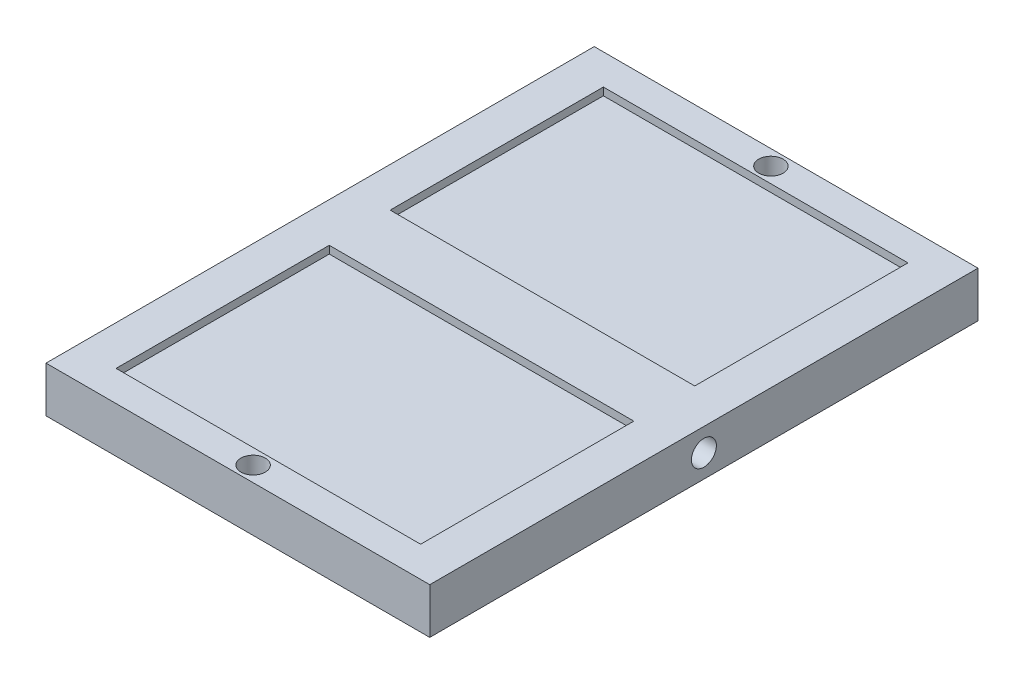
ISO-10303-21;
HEADER;
FILE_DESCRIPTION(('STEP AP214'),'2;1');
FILE_NAME('part.step','',(''),(''),'','','');
FILE_SCHEMA(('AUTOMOTIVE_DESIGN { 1 0 10303 214 1 1 1 1 }'));
ENDSEC;
DATA;
#1=APPLICATION_CONTEXT('core data for automotive mechanical design processes');
#2=APPLICATION_PROTOCOL_DEFINITION('international standard','automotive_design',2000,#1);
#3=PRODUCT_CONTEXT('',#1,'mechanical');
#4=PRODUCT('Part','Part','',(#3));
#5=PRODUCT_RELATED_PRODUCT_CATEGORY('part','',(#4));
#6=PRODUCT_DEFINITION_FORMATION('','',#4);
#7=PRODUCT_DEFINITION_CONTEXT('part definition',#1,'design');
#8=PRODUCT_DEFINITION('design','',#6,#7);
#9=PRODUCT_DEFINITION_SHAPE('','',#8);
#10=(LENGTH_UNIT() NAMED_UNIT(*) SI_UNIT(.MILLI.,.METRE.));
#11=(NAMED_UNIT(*) PLANE_ANGLE_UNIT() SI_UNIT($,.RADIAN.));
#12=(NAMED_UNIT(*) SI_UNIT($,.STERADIAN.) SOLID_ANGLE_UNIT());
#13=UNCERTAINTY_MEASURE_WITH_UNIT(LENGTH_MEASURE(1.E-05),#10,'distance_accuracy_value','');
#14=(GEOMETRIC_REPRESENTATION_CONTEXT(3) GLOBAL_UNCERTAINTY_ASSIGNED_CONTEXT((#13)) GLOBAL_UNIT_ASSIGNED_CONTEXT((#10,
#11,#12)) REPRESENTATION_CONTEXT('',''));
#15=CARTESIAN_POINT('',(0.,0.,0.));
#16=DIRECTION('',(0.,0.,1.));
#17=DIRECTION('',(1.,0.,0.));
#18=AXIS2_PLACEMENT_3D('',#15,#16,#17);
#19=CARTESIAN_POINT('',(-63.,15.,-90.));
#20=DIRECTION('',(1.,0.,0.));
#21=DIRECTION('',(0.,0.,-1.));
#22=AXIS2_PLACEMENT_3D('',#19,#20,#21);
#23=PLANE('',#22);
#24=CARTESIAN_POINT('',(-63.,7.5,0.));
#25=DIRECTION('',(1.,0.,0.));
#26=DIRECTION('',(0.,0.,-1.));
#27=AXIS2_PLACEMENT_3D('',#24,#25,#26);
#28=CIRCLE('',#27,4.1);
#29=CARTESIAN_POINT('',(-63.,7.5,-4.1));
#30=VERTEX_POINT('',#29);
#31=EDGE_CURVE('E303',#30,#30,#28,.T.);
#32=ORIENTED_EDGE('',*,*,#31,.T.);
#33=EDGE_LOOP('',(#32));
#34=FACE_BOUND('',#33,.T.);
#35=DIRECTION('',(0.,0.,1.));
#36=VECTOR('',#35,1.);
#37=CARTESIAN_POINT('',(-63.,0.,-90.));
#38=LINE('',#37,#36);
#39=CARTESIAN_POINT('',(-63.,0.,-90.));
#40=VERTEX_POINT('',#39);
#41=CARTESIAN_POINT('',(-63.,0.,90.));
#42=VERTEX_POINT('',#41);
#43=EDGE_CURVE('E160',#40,#42,#38,.T.);
#44=ORIENTED_EDGE('',*,*,#43,.T.);
#45=DIRECTION('',(0.,-1.,0.));
#46=VECTOR('',#45,1.);
#47=CARTESIAN_POINT('',(-63.,15.,90.));
#48=LINE('',#47,#46);
#49=CARTESIAN_POINT('',(-63.,15.,90.));
#50=VERTEX_POINT('',#49);
#51=EDGE_CURVE('E11',#50,#42,#48,.T.);
#52=ORIENTED_EDGE('',*,*,#51,.F.);
#53=DIRECTION('',(0.,0.,1.));
#54=VECTOR('',#53,1.);
#55=CARTESIAN_POINT('',(-63.,15.,-90.));
#56=LINE('',#55,#54);
#57=CARTESIAN_POINT('',(-63.,15.,-90.));
#58=VERTEX_POINT('',#57);
#59=EDGE_CURVE('E193',#58,#50,#56,.T.);
#60=ORIENTED_EDGE('',*,*,#59,.F.);
#61=DIRECTION('',(0.,-1.,0.));
#62=VECTOR('',#61,1.);
#63=CARTESIAN_POINT('',(-63.,15.,-90.));
#64=LINE('',#63,#62);
#65=EDGE_CURVE('E203',#58,#40,#64,.T.);
#66=ORIENTED_EDGE('',*,*,#65,.T.);
#67=EDGE_LOOP('',(#44,#52,#60,#66));
#68=FACE_BOUND('',#67,.T.);
#69=ADVANCED_FACE('F33',(#34,#68),#23,.F.);
#70=CARTESIAN_POINT('',(63.,15.,90.));
#71=DIRECTION('',(0.,0.,-1.));
#72=DIRECTION('',(-1.,0.,0.));
#73=AXIS2_PLACEMENT_3D('',#70,#71,#72);
#74=PLANE('',#73);
#75=DIRECTION('',(1.,0.,0.));
#76=VECTOR('',#75,1.);
#77=CARTESIAN_POINT('',(63.,0.,90.));
#78=LINE('',#77,#76);
#79=CARTESIAN_POINT('',(63.,0.,90.));
#80=VERTEX_POINT('',#79);
#81=EDGE_CURVE('E206',#42,#80,#78,.T.);
#82=ORIENTED_EDGE('',*,*,#81,.T.);
#83=DIRECTION('',(0.,-1.,0.));
#84=VECTOR('',#83,1.);
#85=CARTESIAN_POINT('',(63.,15.,90.));
#86=LINE('',#85,#84);
#87=CARTESIAN_POINT('',(63.,15.,90.));
#88=VERTEX_POINT('',#87);
#89=EDGE_CURVE('E40',#88,#80,#86,.T.);
#90=ORIENTED_EDGE('',*,*,#89,.F.);
#91=DIRECTION('',(1.,0.,0.));
#92=VECTOR('',#91,1.);
#93=CARTESIAN_POINT('',(63.,15.,90.));
#94=LINE('',#93,#92);
#95=EDGE_CURVE('E196',#50,#88,#94,.T.);
#96=ORIENTED_EDGE('',*,*,#95,.F.);
#97=ORIENTED_EDGE('',*,*,#51,.T.);
#98=EDGE_LOOP('',(#82,#90,#96,#97));
#99=FACE_BOUND('',#98,.T.);
#100=ADVANCED_FACE('F236',(#99),#74,.F.);
#101=CARTESIAN_POINT('',(63.,15.,-90.));
#102=DIRECTION('',(-1.,0.,0.));
#103=DIRECTION('',(0.,0.,1.));
#104=AXIS2_PLACEMENT_3D('',#101,#102,#103);
#105=PLANE('',#104);
#106=CARTESIAN_POINT('',(63.,7.5,0.));
#107=DIRECTION('',(1.,0.,0.));
#108=DIRECTION('',(0.,0.,-1.));
#109=AXIS2_PLACEMENT_3D('',#106,#107,#108);
#110=CIRCLE('',#109,4.1);
#111=CARTESIAN_POINT('',(63.,7.5,-4.1));
#112=VERTEX_POINT('',#111);
#113=EDGE_CURVE('E306',#112,#112,#110,.T.);
#114=ORIENTED_EDGE('',*,*,#113,.F.);
#115=EDGE_LOOP('',(#114));
#116=FACE_BOUND('',#115,.T.);
#117=DIRECTION('',(0.,0.,-1.));
#118=VECTOR('',#117,1.);
#119=CARTESIAN_POINT('',(63.,0.,-90.));
#120=LINE('',#119,#118);
#121=CARTESIAN_POINT('',(63.,0.,-90.));
#122=VERTEX_POINT('',#121);
#123=EDGE_CURVE('E208',#80,#122,#120,.T.);
#124=ORIENTED_EDGE('',*,*,#123,.T.);
#125=DIRECTION('',(0.,-1.,0.));
#126=VECTOR('',#125,1.);
#127=CARTESIAN_POINT('',(63.,15.,-90.));
#128=LINE('',#127,#126);
#129=CARTESIAN_POINT('',(63.,15.,-90.));
#130=VERTEX_POINT('',#129);
#131=EDGE_CURVE('E213',#130,#122,#128,.T.);
#132=ORIENTED_EDGE('',*,*,#131,.F.);
#133=DIRECTION('',(0.,0.,-1.));
#134=VECTOR('',#133,1.);
#135=CARTESIAN_POINT('',(63.,15.,-90.));
#136=LINE('',#135,#134);
#137=EDGE_CURVE('E199',#88,#130,#136,.T.);
#138=ORIENTED_EDGE('',*,*,#137,.F.);
#139=ORIENTED_EDGE('',*,*,#89,.T.);
#140=EDGE_LOOP('',(#124,#132,#138,#139));
#141=FACE_BOUND('',#140,.T.);
#142=ADVANCED_FACE('F220',(#116,#141),#105,.F.);
#143=CARTESIAN_POINT('',(63.,15.,-90.));
#144=DIRECTION('',(0.,0.,1.));
#145=DIRECTION('',(1.,0.,0.));
#146=AXIS2_PLACEMENT_3D('',#143,#144,#145);
#147=PLANE('',#146);
#148=DIRECTION('',(-1.,0.,0.));
#149=VECTOR('',#148,1.);
#150=CARTESIAN_POINT('',(63.,0.,-90.));
#151=LINE('',#150,#149);
#152=EDGE_CURVE('E197',#122,#40,#151,.T.);
#153=ORIENTED_EDGE('',*,*,#152,.T.);
#154=ORIENTED_EDGE('',*,*,#65,.F.);
#155=DIRECTION('',(-1.,0.,0.));
#156=VECTOR('',#155,1.);
#157=CARTESIAN_POINT('',(63.,15.,-90.));
#158=LINE('',#157,#156);
#159=EDGE_CURVE('E201',#130,#58,#158,.T.);
#160=ORIENTED_EDGE('',*,*,#159,.F.);
#161=ORIENTED_EDGE('',*,*,#131,.T.);
#162=EDGE_LOOP('',(#153,#154,#160,#161));
#163=FACE_BOUND('',#162,.T.);
#164=ADVANCED_FACE('F229',(#163),#147,.F.);
#165=CARTESIAN_POINT('',(0.,15.,0.));
#166=DIRECTION('',(0.,-1.,0.));
#167=DIRECTION('',(0.,0.,-1.));
#168=AXIS2_PLACEMENT_3D('',#165,#166,#167);
#169=PLANE('',#168);
#170=CARTESIAN_POINT('',(0.,15.,85.));
#171=DIRECTION('',(0.,-1.,0.));
#172=DIRECTION('',(0.,0.,-1.));
#173=AXIS2_PLACEMENT_3D('',#170,#171,#172);
#174=CIRCLE('',#173,4.);
#175=CARTESIAN_POINT('',(0.,15.,81.));
#176=VERTEX_POINT('',#175);
#177=EDGE_CURVE('E147',#176,#176,#174,.F.);
#178=ORIENTED_EDGE('',*,*,#177,.F.);
#179=EDGE_LOOP('',(#178));
#180=FACE_BOUND('',#179,.T.);
#181=CARTESIAN_POINT('',(0.,15.,-85.));
#182=DIRECTION('',(0.,-1.,0.));
#183=DIRECTION('',(0.,0.,-1.));
#184=AXIS2_PLACEMENT_3D('',#181,#182,#183);
#185=CIRCLE('',#184,4.);
#186=CARTESIAN_POINT('',(0.,15.,-89.));
#187=VERTEX_POINT('',#186);
#188=EDGE_CURVE('E314',#187,#187,#185,.F.);
#189=ORIENTED_EDGE('',*,*,#188,.F.);
#190=EDGE_LOOP('',(#189));
#191=FACE_BOUND('',#190,.T.);
#192=DIRECTION('',(1.,0.,0.));
#193=VECTOR('',#192,1.);
#194=CARTESIAN_POINT('',(-50.,15.,80.));
#195=LINE('',#194,#193);
#196=CARTESIAN_POINT('',(-50.,15.,80.));
#197=VERTEX_POINT('',#196);
#198=CARTESIAN_POINT('',(50.,15.,80.));
#199=VERTEX_POINT('',#198);
#200=EDGE_CURVE('E153',#197,#199,#195,.T.);
#201=ORIENTED_EDGE('',*,*,#200,.F.);
#202=DIRECTION('',(0.,0.,1.));
#203=VECTOR('',#202,1.);
#204=CARTESIAN_POINT('',(-50.,15.,10.));
#205=LINE('',#204,#203);
#206=CARTESIAN_POINT('',(-50.,15.,10.));
#207=VERTEX_POINT('',#206);
#208=EDGE_CURVE('E47',#207,#197,#205,.T.);
#209=ORIENTED_EDGE('',*,*,#208,.F.);
#210=DIRECTION('',(-1.,0.,0.));
#211=VECTOR('',#210,1.);
#212=CARTESIAN_POINT('',(-50.,15.,10.));
#213=LINE('',#212,#211);
#214=CARTESIAN_POINT('',(50.,15.,10.));
#215=VERTEX_POINT('',#214);
#216=EDGE_CURVE('E141',#215,#207,#213,.T.);
#217=ORIENTED_EDGE('',*,*,#216,.F.);
#218=DIRECTION('',(0.,0.,-1.));
#219=VECTOR('',#218,1.);
#220=CARTESIAN_POINT('',(50.,15.,10.));
#221=LINE('',#220,#219);
#222=EDGE_CURVE('E144',#199,#215,#221,.T.);
#223=ORIENTED_EDGE('',*,*,#222,.F.);
#224=EDGE_LOOP('',(#201,#209,#217,#223));
#225=FACE_BOUND('',#224,.T.);
#226=DIRECTION('',(0.,0.,-1.));
#227=VECTOR('',#226,1.);
#228=CARTESIAN_POINT('',(50.,15.,-10.));
#229=LINE('',#228,#227);
#230=CARTESIAN_POINT('',(50.,15.,-10.));
#231=VERTEX_POINT('',#230);
#232=CARTESIAN_POINT('',(50.,15.,-80.));
#233=VERTEX_POINT('',#232);
#234=EDGE_CURVE('E179',#231,#233,#229,.T.);
#235=ORIENTED_EDGE('',*,*,#234,.F.);
#236=DIRECTION('',(1.,0.,0.));
#237=VECTOR('',#236,1.);
#238=CARTESIAN_POINT('',(-50.,15.,-10.));
#239=LINE('',#238,#237);
#240=CARTESIAN_POINT('',(-50.,15.,-10.));
#241=VERTEX_POINT('',#240);
#242=EDGE_CURVE('E55',#241,#231,#239,.T.);
#243=ORIENTED_EDGE('',*,*,#242,.F.);
#244=DIRECTION('',(0.,0.,1.));
#245=VECTOR('',#244,1.);
#246=CARTESIAN_POINT('',(-50.,15.,-10.));
#247=LINE('',#246,#245);
#248=CARTESIAN_POINT('',(-50.,15.,-80.));
#249=VERTEX_POINT('',#248);
#250=EDGE_CURVE('E168',#249,#241,#247,.T.);
#251=ORIENTED_EDGE('',*,*,#250,.F.);
#252=DIRECTION('',(-1.,0.,0.));
#253=VECTOR('',#252,1.);
#254=CARTESIAN_POINT('',(-50.,15.,-80.));
#255=LINE('',#254,#253);
#256=EDGE_CURVE('E182',#233,#249,#255,.T.);
#257=ORIENTED_EDGE('',*,*,#256,.F.);
#258=EDGE_LOOP('',(#235,#243,#251,#257));
#259=FACE_BOUND('',#258,.T.);
#260=ORIENTED_EDGE('',*,*,#59,.T.);
#261=ORIENTED_EDGE('',*,*,#95,.T.);
#262=ORIENTED_EDGE('',*,*,#137,.T.);
#263=ORIENTED_EDGE('',*,*,#159,.T.);
#264=EDGE_LOOP('',(#260,#261,#262,#263));
#265=FACE_BOUND('',#264,.T.);
#266=ADVANCED_FACE('F235',(#180,#191,#225,#259,#265),#169,.F.);
#267=CARTESIAN_POINT('',(0.,0.,0.));
#268=DIRECTION('',(0.,-1.,0.));
#269=DIRECTION('',(0.,0.,-1.));
#270=AXIS2_PLACEMENT_3D('',#267,#268,#269);
#271=PLANE('',#270);
#272=CARTESIAN_POINT('',(0.,0.,85.));
#273=DIRECTION('',(0.,1.,0.));
#274=DIRECTION('',(0.,0.,1.));
#275=AXIS2_PLACEMENT_3D('',#272,#273,#274);
#276=CIRCLE('',#275,4.);
#277=CARTESIAN_POINT('',(0.,0.,89.));
#278=VERTEX_POINT('',#277);
#279=EDGE_CURVE('E311',#278,#278,#276,.T.);
#280=ORIENTED_EDGE('',*,*,#279,.T.);
#281=EDGE_LOOP('',(#280));
#282=FACE_BOUND('',#281,.T.);
#283=CARTESIAN_POINT('',(0.,0.,-85.));
#284=DIRECTION('',(0.,1.,0.));
#285=DIRECTION('',(0.,0.,-1.));
#286=AXIS2_PLACEMENT_3D('',#283,#284,#285);
#287=CIRCLE('',#286,4.);
#288=CARTESIAN_POINT('',(0.,0.,-89.));
#289=VERTEX_POINT('',#288);
#290=EDGE_CURVE('E308',#289,#289,#287,.T.);
#291=ORIENTED_EDGE('',*,*,#290,.T.);
#292=EDGE_LOOP('',(#291));
#293=FACE_BOUND('',#292,.T.);
#294=ORIENTED_EDGE('',*,*,#43,.F.);
#295=ORIENTED_EDGE('',*,*,#152,.F.);
#296=ORIENTED_EDGE('',*,*,#123,.F.);
#297=ORIENTED_EDGE('',*,*,#81,.F.);
#298=EDGE_LOOP('',(#294,#295,#296,#297));
#299=FACE_BOUND('',#298,.T.);
#300=ADVANCED_FACE('F226',(#282,#293,#299),#271,.T.);
#301=CARTESIAN_POINT('',(-50.,12.5,-10.));
#302=DIRECTION('',(0.,0.,1.));
#303=DIRECTION('',(1.,0.,0.));
#304=AXIS2_PLACEMENT_3D('',#301,#302,#303);
#305=PLANE('',#304);
#306=ORIENTED_EDGE('',*,*,#242,.T.);
#307=DIRECTION('',(0.,1.,0.));
#308=VECTOR('',#307,1.);
#309=CARTESIAN_POINT('',(50.,12.5,-10.));
#310=LINE('',#309,#308);
#311=CARTESIAN_POINT('',(50.,12.5,-10.));
#312=VERTEX_POINT('',#311);
#313=EDGE_CURVE('E177',#312,#231,#310,.T.);
#314=ORIENTED_EDGE('',*,*,#313,.F.);
#315=DIRECTION('',(1.,0.,0.));
#316=VECTOR('',#315,1.);
#317=CARTESIAN_POINT('',(-50.,12.5,-10.));
#318=LINE('',#317,#316);
#319=CARTESIAN_POINT('',(-50.,12.5,-10.));
#320=VERTEX_POINT('',#319);
#321=EDGE_CURVE('E164',#320,#312,#318,.T.);
#322=ORIENTED_EDGE('',*,*,#321,.F.);
#323=DIRECTION('',(0.,1.,0.));
#324=VECTOR('',#323,1.);
#325=CARTESIAN_POINT('',(-50.,12.5,-10.));
#326=LINE('',#325,#324);
#327=EDGE_CURVE('E154',#320,#241,#326,.T.);
#328=ORIENTED_EDGE('',*,*,#327,.T.);
#329=EDGE_LOOP('',(#306,#314,#322,#328));
#330=FACE_BOUND('',#329,.T.);
#331=ADVANCED_FACE('F250',(#330),#305,.F.);
#332=CARTESIAN_POINT('',(-50.,12.5,-10.));
#333=DIRECTION('',(-1.,0.,0.));
#334=DIRECTION('',(0.,0.,1.));
#335=AXIS2_PLACEMENT_3D('',#332,#333,#334);
#336=PLANE('',#335);
#337=ORIENTED_EDGE('',*,*,#250,.T.);
#338=ORIENTED_EDGE('',*,*,#327,.F.);
#339=DIRECTION('',(0.,0.,1.));
#340=VECTOR('',#339,1.);
#341=CARTESIAN_POINT('',(-50.,12.5,-10.));
#342=LINE('',#341,#340);
#343=CARTESIAN_POINT('',(-50.,12.5,-80.));
#344=VERTEX_POINT('',#343);
#345=EDGE_CURVE('E174',#344,#320,#342,.T.);
#346=ORIENTED_EDGE('',*,*,#345,.F.);
#347=DIRECTION('',(0.,1.,0.));
#348=VECTOR('',#347,1.);
#349=CARTESIAN_POINT('',(-50.,12.5,-80.));
#350=LINE('',#349,#348);
#351=EDGE_CURVE('E188',#344,#249,#350,.T.);
#352=ORIENTED_EDGE('',*,*,#351,.T.);
#353=EDGE_LOOP('',(#337,#338,#346,#352));
#354=FACE_BOUND('',#353,.T.);
#355=ADVANCED_FACE('F257',(#354),#336,.F.);
#356=CARTESIAN_POINT('',(-50.,12.5,-80.));
#357=DIRECTION('',(0.,0.,-1.));
#358=DIRECTION('',(-1.,0.,0.));
#359=AXIS2_PLACEMENT_3D('',#356,#357,#358);
#360=PLANE('',#359);
#361=ORIENTED_EDGE('',*,*,#256,.T.);
#362=ORIENTED_EDGE('',*,*,#351,.F.);
#363=DIRECTION('',(-1.,0.,0.));
#364=VECTOR('',#363,1.);
#365=CARTESIAN_POINT('',(-50.,12.5,-80.));
#366=LINE('',#365,#364);
#367=CARTESIAN_POINT('',(50.,12.5,-80.));
#368=VERTEX_POINT('',#367);
#369=EDGE_CURVE('E171',#368,#344,#366,.T.);
#370=ORIENTED_EDGE('',*,*,#369,.F.);
#371=DIRECTION('',(0.,1.,0.));
#372=VECTOR('',#371,1.);
#373=CARTESIAN_POINT('',(50.,12.5,-80.));
#374=LINE('',#373,#372);
#375=EDGE_CURVE('E190',#368,#233,#374,.T.);
#376=ORIENTED_EDGE('',*,*,#375,.T.);
#377=EDGE_LOOP('',(#361,#362,#370,#376));
#378=FACE_BOUND('',#377,.T.);
#379=ADVANCED_FACE('F262',(#378),#360,.F.);
#380=CARTESIAN_POINT('',(50.,12.5,-10.));
#381=DIRECTION('',(1.,0.,0.));
#382=DIRECTION('',(0.,0.,-1.));
#383=AXIS2_PLACEMENT_3D('',#380,#381,#382);
#384=PLANE('',#383);
#385=ORIENTED_EDGE('',*,*,#234,.T.);
#386=ORIENTED_EDGE('',*,*,#375,.F.);
#387=DIRECTION('',(0.,0.,-1.));
#388=VECTOR('',#387,1.);
#389=CARTESIAN_POINT('',(50.,12.5,-10.));
#390=LINE('',#389,#388);
#391=EDGE_CURVE('E167',#312,#368,#390,.T.);
#392=ORIENTED_EDGE('',*,*,#391,.F.);
#393=ORIENTED_EDGE('',*,*,#313,.T.);
#394=EDGE_LOOP('',(#385,#386,#392,#393));
#395=FACE_BOUND('',#394,.T.);
#396=ADVANCED_FACE('F258',(#395),#384,.F.);
#397=CARTESIAN_POINT('',(0.,12.5,0.));
#398=DIRECTION('',(0.,1.,0.));
#399=DIRECTION('',(0.,0.,1.));
#400=AXIS2_PLACEMENT_3D('',#397,#398,#399);
#401=PLANE('',#400);
#402=ORIENTED_EDGE('',*,*,#321,.T.);
#403=ORIENTED_EDGE('',*,*,#391,.T.);
#404=ORIENTED_EDGE('',*,*,#369,.T.);
#405=ORIENTED_EDGE('',*,*,#345,.T.);
#406=EDGE_LOOP('',(#402,#403,#404,#405));
#407=FACE_BOUND('',#406,.T.);
#408=ADVANCED_FACE('F261',(#407),#401,.T.);
#409=CARTESIAN_POINT('',(-50.,12.5,10.));
#410=DIRECTION('',(-1.,0.,0.));
#411=DIRECTION('',(0.,0.,1.));
#412=AXIS2_PLACEMENT_3D('',#409,#410,#411);
#413=PLANE('',#412);
#414=ORIENTED_EDGE('',*,*,#208,.T.);
#415=DIRECTION('',(0.,1.,0.));
#416=VECTOR('',#415,1.);
#417=CARTESIAN_POINT('',(-50.,12.5,80.));
#418=LINE('',#417,#416);
#419=CARTESIAN_POINT('',(-50.,12.5,80.));
#420=VERTEX_POINT('',#419);
#421=EDGE_CURVE('E119',#420,#197,#418,.T.);
#422=ORIENTED_EDGE('',*,*,#421,.F.);
#423=DIRECTION('',(0.,0.,1.));
#424=VECTOR('',#423,1.);
#425=CARTESIAN_POINT('',(-50.,12.5,10.));
#426=LINE('',#425,#424);
#427=CARTESIAN_POINT('',(-50.,12.5,10.));
#428=VERTEX_POINT('',#427);
#429=EDGE_CURVE('E123',#428,#420,#426,.T.);
#430=ORIENTED_EDGE('',*,*,#429,.F.);
#431=DIRECTION('',(0.,1.,0.));
#432=VECTOR('',#431,1.);
#433=CARTESIAN_POINT('',(-50.,12.5,10.));
#434=LINE('',#433,#432);
#435=EDGE_CURVE('E158',#428,#207,#434,.T.);
#436=ORIENTED_EDGE('',*,*,#435,.T.);
#437=EDGE_LOOP('',(#414,#422,#430,#436));
#438=FACE_BOUND('',#437,.T.);
#439=ADVANCED_FACE('F121',(#438),#413,.F.);
#440=CARTESIAN_POINT('',(-50.,12.5,10.));
#441=DIRECTION('',(0.,0.,-1.));
#442=DIRECTION('',(-1.,0.,0.));
#443=AXIS2_PLACEMENT_3D('',#440,#441,#442);
#444=PLANE('',#443);
#445=ORIENTED_EDGE('',*,*,#216,.T.);
#446=ORIENTED_EDGE('',*,*,#435,.F.);
#447=DIRECTION('',(-1.,0.,0.));
#448=VECTOR('',#447,1.);
#449=CARTESIAN_POINT('',(-50.,12.5,10.));
#450=LINE('',#449,#448);
#451=CARTESIAN_POINT('',(50.,12.5,10.));
#452=VERTEX_POINT('',#451);
#453=EDGE_CURVE('E129',#452,#428,#450,.T.);
#454=ORIENTED_EDGE('',*,*,#453,.F.);
#455=DIRECTION('',(0.,1.,0.));
#456=VECTOR('',#455,1.);
#457=CARTESIAN_POINT('',(50.,12.5,10.));
#458=LINE('',#457,#456);
#459=EDGE_CURVE('E161',#452,#215,#458,.T.);
#460=ORIENTED_EDGE('',*,*,#459,.T.);
#461=EDGE_LOOP('',(#445,#446,#454,#460));
#462=FACE_BOUND('',#461,.T.);
#463=ADVANCED_FACE('F275',(#462),#444,.F.);
#464=CARTESIAN_POINT('',(50.,12.5,10.));
#465=DIRECTION('',(1.,0.,0.));
#466=DIRECTION('',(0.,0.,-1.));
#467=AXIS2_PLACEMENT_3D('',#464,#465,#466);
#468=PLANE('',#467);
#469=ORIENTED_EDGE('',*,*,#222,.T.);
#470=ORIENTED_EDGE('',*,*,#459,.F.);
#471=DIRECTION('',(0.,0.,-1.));
#472=VECTOR('',#471,1.);
#473=CARTESIAN_POINT('',(50.,12.5,10.));
#474=LINE('',#473,#472);
#475=CARTESIAN_POINT('',(50.,12.5,80.));
#476=VERTEX_POINT('',#475);
#477=EDGE_CURVE('E137',#476,#452,#474,.T.);
#478=ORIENTED_EDGE('',*,*,#477,.F.);
#479=DIRECTION('',(0.,1.,0.));
#480=VECTOR('',#479,1.);
#481=CARTESIAN_POINT('',(50.,12.5,80.));
#482=LINE('',#481,#480);
#483=EDGE_CURVE('E128',#476,#199,#482,.T.);
#484=ORIENTED_EDGE('',*,*,#483,.T.);
#485=EDGE_LOOP('',(#469,#470,#478,#484));
#486=FACE_BOUND('',#485,.T.);
#487=ADVANCED_FACE('F278',(#486),#468,.F.);
#488=CARTESIAN_POINT('',(-50.,12.5,80.));
#489=DIRECTION('',(0.,0.,1.));
#490=DIRECTION('',(1.,0.,0.));
#491=AXIS2_PLACEMENT_3D('',#488,#489,#490);
#492=PLANE('',#491);
#493=ORIENTED_EDGE('',*,*,#200,.T.);
#494=ORIENTED_EDGE('',*,*,#483,.F.);
#495=DIRECTION('',(1.,0.,0.));
#496=VECTOR('',#495,1.);
#497=CARTESIAN_POINT('',(-50.,12.5,80.));
#498=LINE('',#497,#496);
#499=EDGE_CURVE('E132',#420,#476,#498,.T.);
#500=ORIENTED_EDGE('',*,*,#499,.F.);
#501=ORIENTED_EDGE('',*,*,#421,.T.);
#502=EDGE_LOOP('',(#493,#494,#500,#501));
#503=FACE_BOUND('',#502,.T.);
#504=ADVANCED_FACE('F133',(#503),#492,.F.);
#505=CARTESIAN_POINT('',(0.,12.5,0.));
#506=DIRECTION('',(0.,1.,0.));
#507=DIRECTION('',(0.,0.,1.));
#508=AXIS2_PLACEMENT_3D('',#505,#506,#507);
#509=PLANE('',#508);
#510=ORIENTED_EDGE('',*,*,#429,.T.);
#511=ORIENTED_EDGE('',*,*,#499,.T.);
#512=ORIENTED_EDGE('',*,*,#477,.T.);
#513=ORIENTED_EDGE('',*,*,#453,.T.);
#514=EDGE_LOOP('',(#510,#511,#512,#513));
#515=FACE_BOUND('',#514,.T.);
#516=ADVANCED_FACE('F139',(#515),#509,.T.);
#517=CARTESIAN_POINT('',(0.,32.5,-85.));
#518=DIRECTION('',(0.,-1.,0.));
#519=DIRECTION('',(0.,0.,-1.));
#520=AXIS2_PLACEMENT_3D('',#517,#518,#519);
#521=CYLINDRICAL_SURFACE('',#520,4.);
#522=ORIENTED_EDGE('',*,*,#290,.F.);
#523=EDGE_LOOP('',(#522));
#524=FACE_BOUND('',#523,.T.);
#525=ORIENTED_EDGE('',*,*,#188,.T.);
#526=EDGE_LOOP('',(#525));
#527=FACE_BOUND('',#526,.T.);
#528=ADVANCED_FACE('F287',(#524,#527),#521,.F.);
#529=CARTESIAN_POINT('',(0.,32.5,85.));
#530=DIRECTION('',(0.,-1.,0.));
#531=DIRECTION('',(0.,0.,-1.));
#532=AXIS2_PLACEMENT_3D('',#529,#530,#531);
#533=CYLINDRICAL_SURFACE('',#532,4.);
#534=ORIENTED_EDGE('',*,*,#279,.F.);
#535=EDGE_LOOP('',(#534));
#536=FACE_BOUND('',#535,.T.);
#537=ORIENTED_EDGE('',*,*,#177,.T.);
#538=EDGE_LOOP('',(#537));
#539=FACE_BOUND('',#538,.T.);
#540=ADVANCED_FACE('F290',(#536,#539),#533,.F.);
#541=CARTESIAN_POINT('',(-63.,7.5,0.));
#542=DIRECTION('',(1.,0.,0.));
#543=DIRECTION('',(0.,0.,-1.));
#544=AXIS2_PLACEMENT_3D('',#541,#542,#543);
#545=CYLINDRICAL_SURFACE('',#544,4.1);
#546=ORIENTED_EDGE('',*,*,#31,.F.);
#547=EDGE_LOOP('',(#546));
#548=FACE_BOUND('',#547,.T.);
#549=ORIENTED_EDGE('',*,*,#113,.T.);
#550=EDGE_LOOP('',(#549));
#551=FACE_BOUND('',#550,.T.);
#552=ADVANCED_FACE('F294',(#548,#551),#545,.F.);
#553=CLOSED_SHELL('',(#69,#100,#142,#164,#266,#300,#331,#355,#379,#396,#408,#439,#463,#487,#504,
#516,#528,#540,#552));
#554=MANIFOLD_SOLID_BREP('B2',#553);
#555=ADVANCED_BREP_SHAPE_REPRESENTATION('',(#18,#554),#14);
#556=SHAPE_DEFINITION_REPRESENTATION(#9,#555);
ENDSEC;
END-ISO-10303-21;
